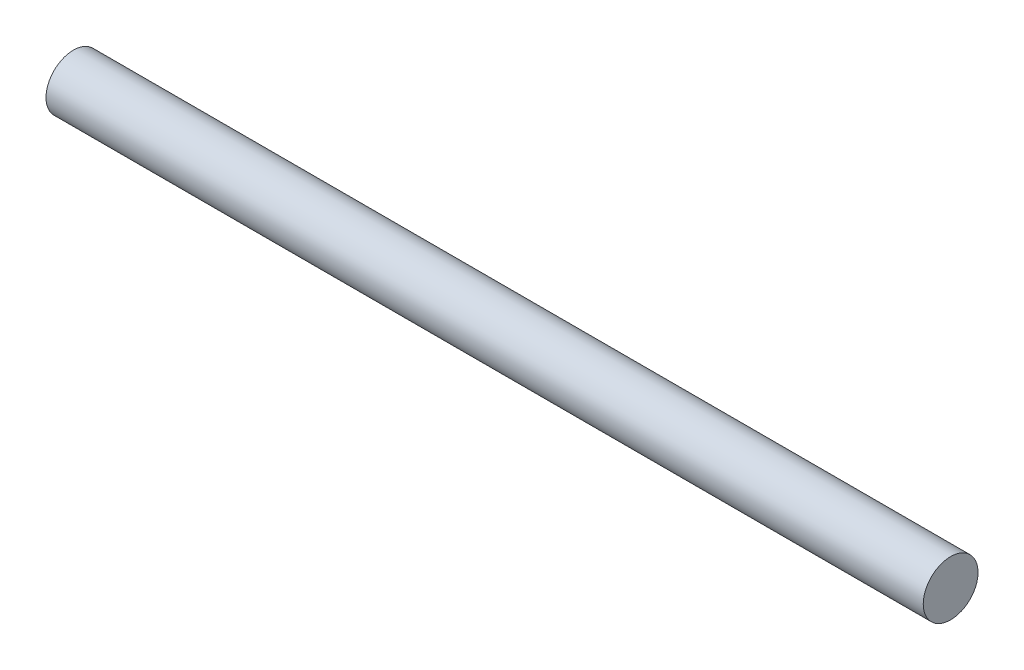
ISO-10303-21;
HEADER;
FILE_DESCRIPTION(('STEP AP214'),'2;1');
FILE_NAME('part.step','',(''),(''),'','','');
FILE_SCHEMA(('AUTOMOTIVE_DESIGN { 1 0 10303 214 1 1 1 1 }'));
ENDSEC;
DATA;
#1=APPLICATION_CONTEXT('core data for automotive mechanical design processes');
#2=APPLICATION_PROTOCOL_DEFINITION('international standard','automotive_design',2000,#1);
#3=PRODUCT_CONTEXT('',#1,'mechanical');
#4=PRODUCT('Part','Part','',(#3));
#5=PRODUCT_RELATED_PRODUCT_CATEGORY('part','',(#4));
#6=PRODUCT_DEFINITION_FORMATION('','',#4);
#7=PRODUCT_DEFINITION_CONTEXT('part definition',#1,'design');
#8=PRODUCT_DEFINITION('design','',#6,#7);
#9=PRODUCT_DEFINITION_SHAPE('','',#8);
#10=(LENGTH_UNIT() NAMED_UNIT(*) SI_UNIT(.MILLI.,.METRE.));
#11=(NAMED_UNIT(*) PLANE_ANGLE_UNIT() SI_UNIT($,.RADIAN.));
#12=(NAMED_UNIT(*) SI_UNIT($,.STERADIAN.) SOLID_ANGLE_UNIT());
#13=UNCERTAINTY_MEASURE_WITH_UNIT(LENGTH_MEASURE(1.E-05),#10,'distance_accuracy_value','');
#14=(GEOMETRIC_REPRESENTATION_CONTEXT(3) GLOBAL_UNCERTAINTY_ASSIGNED_CONTEXT((#13)) GLOBAL_UNIT_ASSIGNED_CONTEXT((#10,
#11,#12)) REPRESENTATION_CONTEXT('',''));
#15=CARTESIAN_POINT('',(0.,0.,0.));
#16=DIRECTION('',(0.,0.,1.));
#17=DIRECTION('',(1.,0.,0.));
#18=AXIS2_PLACEMENT_3D('',#15,#16,#17);
#19=CARTESIAN_POINT('',(0.,0.,0.));
#20=DIRECTION('',(1.,0.,0.));
#21=DIRECTION('',(0.,0.,-1.));
#22=AXIS2_PLACEMENT_3D('',#19,#20,#21);
#23=PLANE('',#22);
#24=CARTESIAN_POINT('',(0.,0.,0.));
#25=DIRECTION('',(-1.,0.,0.));
#26=DIRECTION('',(0.,0.,1.));
#27=AXIS2_PLACEMENT_3D('',#24,#25,#26);
#28=CIRCLE('',#27,15.);
#29=CARTESIAN_POINT('',(0.,0.,15.));
#30=VERTEX_POINT('',#29);
#31=EDGE_CURVE('E10',#30,#30,#28,.T.);
#32=ORIENTED_EDGE('',*,*,#31,.T.);
#33=EDGE_LOOP('',(#32));
#34=FACE_BOUND('',#33,.T.);
#35=ADVANCED_FACE('F37',(#34),#23,.F.);
#36=CARTESIAN_POINT('',(0.,0.,0.));
#37=DIRECTION('',(-1.,0.,0.));
#38=DIRECTION('',(0.,0.,1.));
#39=AXIS2_PLACEMENT_3D('',#36,#37,#38);
#40=CYLINDRICAL_SURFACE('',#39,15.);
#41=ORIENTED_EDGE('',*,*,#31,.F.);
#42=EDGE_LOOP('',(#41));
#43=FACE_BOUND('',#42,.T.);
#44=CARTESIAN_POINT('',(480.,0.,0.));
#45=DIRECTION('',(-1.,0.,0.));
#46=DIRECTION('',(0.,0.,1.));
#47=AXIS2_PLACEMENT_3D('',#44,#45,#46);
#48=CIRCLE('',#47,15.);
#49=CARTESIAN_POINT('',(480.,0.,15.));
#50=VERTEX_POINT('',#49);
#51=EDGE_CURVE('E44',#50,#50,#48,.T.);
#52=ORIENTED_EDGE('',*,*,#51,.T.);
#53=EDGE_LOOP('',(#52));
#54=FACE_BOUND('',#53,.T.);
#55=ADVANCED_FACE('F51',(#43,#54),#40,.T.);
#56=CARTESIAN_POINT('',(480.,0.,0.));
#57=DIRECTION('',(-1.,0.,0.));
#58=DIRECTION('',(0.,0.,1.));
#59=AXIS2_PLACEMENT_3D('',#56,#57,#58);
#60=PLANE('',#59);
#61=ORIENTED_EDGE('',*,*,#51,.F.);
#62=EDGE_LOOP('',(#61));
#63=FACE_BOUND('',#62,.T.);
#64=ADVANCED_FACE('F53',(#63),#60,.F.);
#65=CLOSED_SHELL('',(#35,#55,#64));
#66=MANIFOLD_SOLID_BREP('B2',#65);
#67=ADVANCED_BREP_SHAPE_REPRESENTATION('',(#18,#66),#14);
#68=SHAPE_DEFINITION_REPRESENTATION(#9,#67);
ENDSEC;
END-ISO-10303-21;
